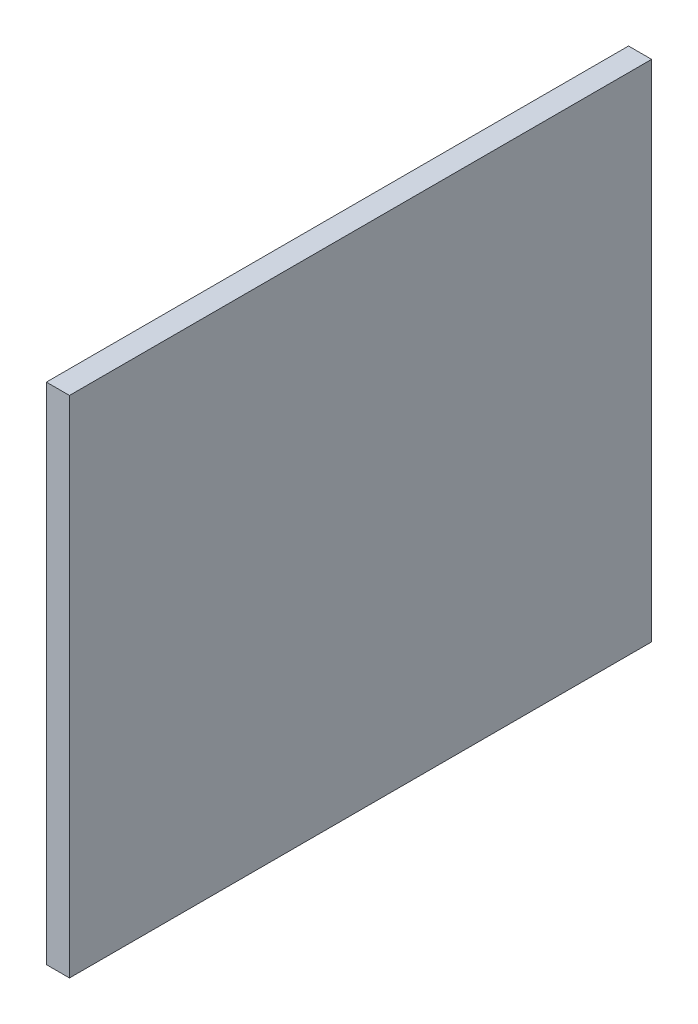
ISO-10303-21;
HEADER;
FILE_DESCRIPTION(('STEP AP214'),'2;1');
FILE_NAME('part.step','',(''),(''),'','','');
FILE_SCHEMA(('AUTOMOTIVE_DESIGN { 1 0 10303 214 1 1 1 1 }'));
ENDSEC;
DATA;
#1=APPLICATION_CONTEXT('core data for automotive mechanical design processes');
#2=APPLICATION_PROTOCOL_DEFINITION('international standard','automotive_design',2000,#1);
#3=PRODUCT_CONTEXT('',#1,'mechanical');
#4=PRODUCT('Part','Part','',(#3));
#5=PRODUCT_RELATED_PRODUCT_CATEGORY('part','',(#4));
#6=PRODUCT_DEFINITION_FORMATION('','',#4);
#7=PRODUCT_DEFINITION_CONTEXT('part definition',#1,'design');
#8=PRODUCT_DEFINITION('design','',#6,#7);
#9=PRODUCT_DEFINITION_SHAPE('','',#8);
#10=(LENGTH_UNIT() NAMED_UNIT(*) SI_UNIT(.MILLI.,.METRE.));
#11=(NAMED_UNIT(*) PLANE_ANGLE_UNIT() SI_UNIT($,.RADIAN.));
#12=(NAMED_UNIT(*) SI_UNIT($,.STERADIAN.) SOLID_ANGLE_UNIT());
#13=UNCERTAINTY_MEASURE_WITH_UNIT(LENGTH_MEASURE(1.E-05),#10,'distance_accuracy_value','');
#14=(GEOMETRIC_REPRESENTATION_CONTEXT(3) GLOBAL_UNCERTAINTY_ASSIGNED_CONTEXT((#13)) GLOBAL_UNIT_ASSIGNED_CONTEXT((#10,
#11,#12)) REPRESENTATION_CONTEXT('',''));
#15=CARTESIAN_POINT('',(0.,0.,0.));
#16=DIRECTION('',(0.,0.,1.));
#17=DIRECTION('',(1.,0.,0.));
#18=AXIS2_PLACEMENT_3D('',#15,#16,#17);
#19=CARTESIAN_POINT('',(4.7625,-52.,-60.));
#20=DIRECTION('',(0.,0.,1.));
#21=DIRECTION('',(1.,0.,0.));
#22=AXIS2_PLACEMENT_3D('',#19,#20,#21);
#23=PLANE('',#22);
#24=DIRECTION('',(0.,1.,0.));
#25=VECTOR('',#24,1.);
#26=CARTESIAN_POINT('',(0.,-52.,-60.));
#27=LINE('',#26,#25);
#28=CARTESIAN_POINT('',(0.,-52.,-60.));
#29=VERTEX_POINT('',#28);
#30=CARTESIAN_POINT('',(0.,52.,-60.));
#31=VERTEX_POINT('',#30);
#32=EDGE_CURVE('E95',#29,#31,#27,.T.);
#33=ORIENTED_EDGE('',*,*,#32,.T.);
#34=DIRECTION('',(-1.,0.,0.));
#35=VECTOR('',#34,1.);
#36=CARTESIAN_POINT('',(4.7625,52.,-60.));
#37=LINE('',#36,#35);
#38=CARTESIAN_POINT('',(4.7625,52.,-60.));
#39=VERTEX_POINT('',#38);
#40=EDGE_CURVE('E11',#39,#31,#37,.T.);
#41=ORIENTED_EDGE('',*,*,#40,.F.);
#42=DIRECTION('',(0.,1.,0.));
#43=VECTOR('',#42,1.);
#44=CARTESIAN_POINT('',(4.7625,-52.,-60.));
#45=LINE('',#44,#43);
#46=CARTESIAN_POINT('',(4.7625,-52.,-60.));
#47=VERTEX_POINT('',#46);
#48=EDGE_CURVE('E83',#47,#39,#45,.T.);
#49=ORIENTED_EDGE('',*,*,#48,.F.);
#50=DIRECTION('',(-1.,0.,0.));
#51=VECTOR('',#50,1.);
#52=CARTESIAN_POINT('',(4.7625,-52.,-60.));
#53=LINE('',#52,#51);
#54=EDGE_CURVE('E91',#47,#29,#53,.T.);
#55=ORIENTED_EDGE('',*,*,#54,.T.);
#56=EDGE_LOOP('',(#33,#41,#49,#55));
#57=FACE_BOUND('',#56,.T.);
#58=ADVANCED_FACE('F32',(#57),#23,.F.);
#59=CARTESIAN_POINT('',(4.7625,52.,60.));
#60=DIRECTION('',(0.,-1.,0.));
#61=DIRECTION('',(0.,0.,-1.));
#62=AXIS2_PLACEMENT_3D('',#59,#60,#61);
#63=PLANE('',#62);
#64=DIRECTION('',(0.,0.,1.));
#65=VECTOR('',#64,1.);
#66=CARTESIAN_POINT('',(0.,52.,60.));
#67=LINE('',#66,#65);
#68=CARTESIAN_POINT('',(0.,52.,60.));
#69=VERTEX_POINT('',#68);
#70=EDGE_CURVE('E87',#31,#69,#67,.T.);
#71=ORIENTED_EDGE('',*,*,#70,.T.);
#72=DIRECTION('',(-1.,0.,0.));
#73=VECTOR('',#72,1.);
#74=CARTESIAN_POINT('',(4.7625,52.,60.));
#75=LINE('',#74,#73);
#76=CARTESIAN_POINT('',(4.7625,52.,60.));
#77=VERTEX_POINT('',#76);
#78=EDGE_CURVE('E40',#77,#69,#75,.T.);
#79=ORIENTED_EDGE('',*,*,#78,.F.);
#80=DIRECTION('',(0.,0.,1.));
#81=VECTOR('',#80,1.);
#82=CARTESIAN_POINT('',(4.7625,52.,60.));
#83=LINE('',#82,#81);
#84=EDGE_CURVE('E78',#39,#77,#83,.T.);
#85=ORIENTED_EDGE('',*,*,#84,.F.);
#86=ORIENTED_EDGE('',*,*,#40,.T.);
#87=EDGE_LOOP('',(#71,#79,#85,#86));
#88=FACE_BOUND('',#87,.T.);
#89=ADVANCED_FACE('F86',(#88),#63,.F.);
#90=CARTESIAN_POINT('',(4.7625,-52.,60.));
#91=DIRECTION('',(0.,0.,-1.));
#92=DIRECTION('',(-1.,0.,0.));
#93=AXIS2_PLACEMENT_3D('',#90,#91,#92);
#94=PLANE('',#93);
#95=DIRECTION('',(0.,-1.,0.));
#96=VECTOR('',#95,1.);
#97=CARTESIAN_POINT('',(0.,-52.,60.));
#98=LINE('',#97,#96);
#99=CARTESIAN_POINT('',(0.,-52.,60.));
#100=VERTEX_POINT('',#99);
#101=EDGE_CURVE('E65',#69,#100,#98,.T.);
#102=ORIENTED_EDGE('',*,*,#101,.T.);
#103=DIRECTION('',(-1.,0.,0.));
#104=VECTOR('',#103,1.);
#105=CARTESIAN_POINT('',(4.7625,-52.,60.));
#106=LINE('',#105,#104);
#107=CARTESIAN_POINT('',(4.7625,-52.,60.));
#108=VERTEX_POINT('',#107);
#109=EDGE_CURVE('E88',#108,#100,#106,.T.);
#110=ORIENTED_EDGE('',*,*,#109,.F.);
#111=DIRECTION('',(0.,-1.,0.));
#112=VECTOR('',#111,1.);
#113=CARTESIAN_POINT('',(4.7625,-52.,60.));
#114=LINE('',#113,#112);
#115=EDGE_CURVE('E81',#77,#108,#114,.T.);
#116=ORIENTED_EDGE('',*,*,#115,.F.);
#117=ORIENTED_EDGE('',*,*,#78,.T.);
#118=EDGE_LOOP('',(#102,#110,#116,#117));
#119=FACE_BOUND('',#118,.T.);
#120=ADVANCED_FACE('F89',(#119),#94,.F.);
#121=CARTESIAN_POINT('',(4.7625,-52.,60.));
#122=DIRECTION('',(0.,1.,0.));
#123=DIRECTION('',(0.,0.,1.));
#124=AXIS2_PLACEMENT_3D('',#121,#122,#123);
#125=PLANE('',#124);
#126=DIRECTION('',(0.,0.,-1.));
#127=VECTOR('',#126,1.);
#128=CARTESIAN_POINT('',(0.,-52.,60.));
#129=LINE('',#128,#127);
#130=EDGE_CURVE('E71',#100,#29,#129,.T.);
#131=ORIENTED_EDGE('',*,*,#130,.T.);
#132=ORIENTED_EDGE('',*,*,#54,.F.);
#133=DIRECTION('',(0.,0.,-1.));
#134=VECTOR('',#133,1.);
#135=CARTESIAN_POINT('',(4.7625,-52.,60.));
#136=LINE('',#135,#134);
#137=EDGE_CURVE('E48',#108,#47,#136,.T.);
#138=ORIENTED_EDGE('',*,*,#137,.F.);
#139=ORIENTED_EDGE('',*,*,#109,.T.);
#140=EDGE_LOOP('',(#131,#132,#138,#139));
#141=FACE_BOUND('',#140,.T.);
#142=ADVANCED_FACE('F102',(#141),#125,.F.);
#143=CARTESIAN_POINT('',(4.7625,0.,0.));
#144=DIRECTION('',(-1.,0.,0.));
#145=DIRECTION('',(0.,0.,1.));
#146=AXIS2_PLACEMENT_3D('',#143,#144,#145);
#147=PLANE('',#146);
#148=ORIENTED_EDGE('',*,*,#48,.T.);
#149=ORIENTED_EDGE('',*,*,#84,.T.);
#150=ORIENTED_EDGE('',*,*,#115,.T.);
#151=ORIENTED_EDGE('',*,*,#137,.T.);
#152=EDGE_LOOP('',(#148,#149,#150,#151));
#153=FACE_BOUND('',#152,.T.);
#154=ADVANCED_FACE('F79',(#153),#147,.F.);
#155=CARTESIAN_POINT('',(0.,0.,0.));
#156=DIRECTION('',(-1.,0.,0.));
#157=DIRECTION('',(0.,0.,1.));
#158=AXIS2_PLACEMENT_3D('',#155,#156,#157);
#159=PLANE('',#158);
#160=ORIENTED_EDGE('',*,*,#32,.F.);
#161=ORIENTED_EDGE('',*,*,#130,.F.);
#162=ORIENTED_EDGE('',*,*,#101,.F.);
#163=ORIENTED_EDGE('',*,*,#70,.F.);
#164=EDGE_LOOP('',(#160,#161,#162,#163));
#165=FACE_BOUND('',#164,.T.);
#166=ADVANCED_FACE('F105',(#165),#159,.T.);
#167=CLOSED_SHELL('',(#58,#89,#120,#142,#154,#166));
#168=MANIFOLD_SOLID_BREP('B2',#167);
#169=ADVANCED_BREP_SHAPE_REPRESENTATION('',(#18,#168),#14);
#170=SHAPE_DEFINITION_REPRESENTATION(#9,#169);
ENDSEC;
END-ISO-10303-21;
